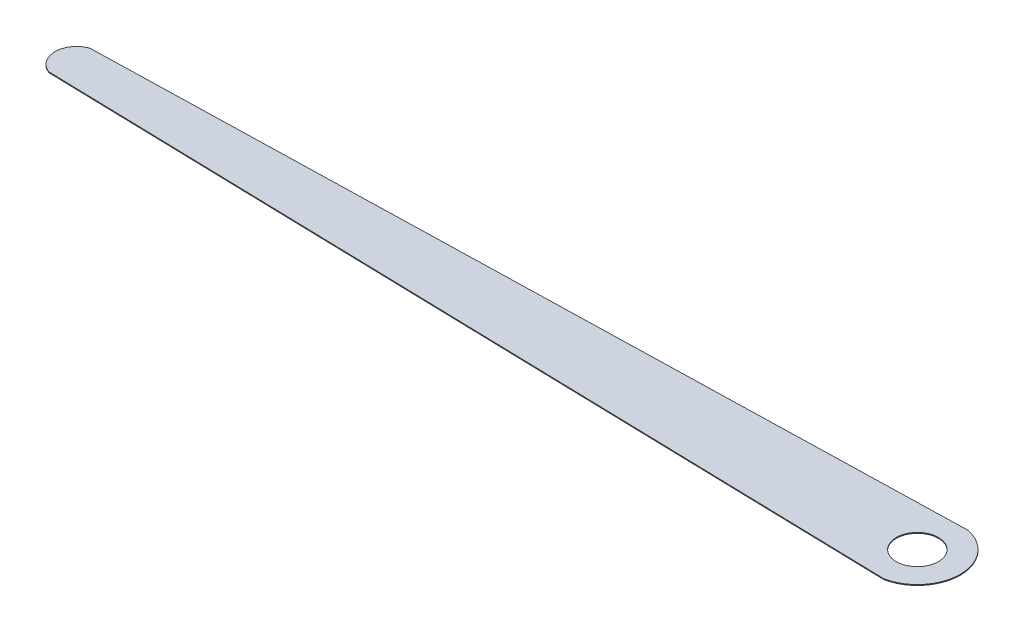
ISO-10303-21;
HEADER;
FILE_DESCRIPTION(('STEP AP214'),'2;1');
FILE_NAME('part.step','',(''),(''),'','','');
FILE_SCHEMA(('AUTOMOTIVE_DESIGN { 1 0 10303 214 1 1 1 1 }'));
ENDSEC;
DATA;
#1=APPLICATION_CONTEXT('core data for automotive mechanical design processes');
#2=APPLICATION_PROTOCOL_DEFINITION('international standard','automotive_design',2000,#1);
#3=PRODUCT_CONTEXT('',#1,'mechanical');
#4=PRODUCT('Part','Part','',(#3));
#5=PRODUCT_RELATED_PRODUCT_CATEGORY('part','',(#4));
#6=PRODUCT_DEFINITION_FORMATION('','',#4);
#7=PRODUCT_DEFINITION_CONTEXT('part definition',#1,'design');
#8=PRODUCT_DEFINITION('design','',#6,#7);
#9=PRODUCT_DEFINITION_SHAPE('','',#8);
#10=(LENGTH_UNIT() NAMED_UNIT(*) SI_UNIT(.MILLI.,.METRE.));
#11=(NAMED_UNIT(*) PLANE_ANGLE_UNIT() SI_UNIT($,.RADIAN.));
#12=(NAMED_UNIT(*) SI_UNIT($,.STERADIAN.) SOLID_ANGLE_UNIT());
#13=UNCERTAINTY_MEASURE_WITH_UNIT(LENGTH_MEASURE(1.E-05),#10,'distance_accuracy_value','');
#14=(GEOMETRIC_REPRESENTATION_CONTEXT(3) GLOBAL_UNCERTAINTY_ASSIGNED_CONTEXT((#13)) GLOBAL_UNIT_ASSIGNED_CONTEXT((#10,
#11,#12)) REPRESENTATION_CONTEXT('',''));
#15=CARTESIAN_POINT('',(0.,0.,0.));
#16=DIRECTION('',(0.,0.,1.));
#17=DIRECTION('',(1.,0.,0.));
#18=AXIS2_PLACEMENT_3D('',#15,#16,#17);
#19=CARTESIAN_POINT('',(-1.02879497937869,0.1,4.99999999999998));
#20=DIRECTION('',(0.,-1.,0.));
#21=DIRECTION('',(0.,0.,-1.));
#22=AXIS2_PLACEMENT_3D('',#19,#20,#21);
#23=PLANE('',#22);
#24=CARTESIAN_POINT('',(-1.02879497937869,0.1,4.99999999999998));
#25=DIRECTION('',(0.,1.,0.));
#26=DIRECTION('',(0.,0.,-1.));
#27=AXIS2_PLACEMENT_3D('',#24,#25,#26);
#28=CIRCLE('',#27,5.1047447643927);
#29=CARTESIAN_POINT('',(0.,0.1,9.99999999999997));
#30=VERTEX_POINT('',#29);
#31=CARTESIAN_POINT('',(0.,0.1,0.));
#32=VERTEX_POINT('',#31);
#33=EDGE_CURVE('E85',#30,#32,#28,.T.);
#34=ORIENTED_EDGE('',*,*,#33,.T.);
#35=DIRECTION('',(-0.999683329306351,0.,0.0251642823654999));
#36=VECTOR('',#35,1.);
#37=CARTESIAN_POINT('',(0.,0.1,0.));
#38=LINE('',#37,#36);
#39=CARTESIAN_POINT('',(-101.873461228566,0.1,2.56438460935946));
#40=VERTEX_POINT('',#39);
#41=EDGE_CURVE('E80',#32,#40,#38,.T.);
#42=ORIENTED_EDGE('',*,*,#41,.T.);
#43=CARTESIAN_POINT('',(-101.028794979379,0.1,4.99999999999998));
#44=DIRECTION('',(0.,1.,0.));
#45=DIRECTION('',(0.,0.,1.));
#46=AXIS2_PLACEMENT_3D('',#43,#44,#45);
#47=CIRCLE('',#46,2.57792230364699);
#48=CARTESIAN_POINT('',(-101.873461228566,0.1,7.4356153906405));
#49=VERTEX_POINT('',#48);
#50=EDGE_CURVE('E83',#40,#49,#47,.T.);
#51=ORIENTED_EDGE('',*,*,#50,.T.);
#52=DIRECTION('',(0.999683329306351,0.,0.0251642823654999));
#53=VECTOR('',#52,1.);
#54=CARTESIAN_POINT('',(-101.873461228566,0.1,7.4356153906405));
#55=LINE('',#54,#53);
#56=EDGE_CURVE('E50',#49,#30,#55,.T.);
#57=ORIENTED_EDGE('',*,*,#56,.T.);
#58=EDGE_LOOP('',(#34,#42,#51,#57));
#59=FACE_BOUND('',#58,.T.);
#60=CARTESIAN_POINT('',(-1.02879497937869,0.1,4.99999999999998));
#61=DIRECTION('',(0.,1.,0.));
#62=DIRECTION('',(0.,0.,1.));
#63=AXIS2_PLACEMENT_3D('',#60,#61,#62);
#64=CIRCLE('',#63,2.5);
#65=CARTESIAN_POINT('',(-1.02879497937869,0.1,7.49999999999998));
#66=VERTEX_POINT('',#65);
#67=EDGE_CURVE('E100',#66,#66,#64,.T.);
#68=ORIENTED_EDGE('',*,*,#67,.F.);
#69=EDGE_LOOP('',(#68));
#70=FACE_BOUND('',#69,.T.);
#71=ADVANCED_FACE('F33',(#59,#70),#23,.F.);
#72=CARTESIAN_POINT('',(-1.02879497937869,0.,4.99999999999998));
#73=DIRECTION('',(0.,-1.,0.));
#74=DIRECTION('',(0.,0.,-1.));
#75=AXIS2_PLACEMENT_3D('',#72,#73,#74);
#76=PLANE('',#75);
#77=CARTESIAN_POINT('',(-1.02879497937869,0.,4.99999999999998));
#78=DIRECTION('',(0.,1.,0.));
#79=DIRECTION('',(0.,0.,-1.));
#80=AXIS2_PLACEMENT_3D('',#77,#78,#79);
#81=CIRCLE('',#80,5.1047447643927);
#82=CARTESIAN_POINT('',(0.,0.,9.99999999999997));
#83=VERTEX_POINT('',#82);
#84=CARTESIAN_POINT('',(0.,0.,0.));
#85=VERTEX_POINT('',#84);
#86=EDGE_CURVE('E97',#83,#85,#81,.T.);
#87=ORIENTED_EDGE('',*,*,#86,.F.);
#88=DIRECTION('',(0.999683329306351,0.,0.0251642823654999));
#89=VECTOR('',#88,1.);
#90=CARTESIAN_POINT('',(-101.873461228566,0.,7.4356153906405));
#91=LINE('',#90,#89);
#92=CARTESIAN_POINT('',(-101.873461228566,0.,7.4356153906405));
#93=VERTEX_POINT('',#92);
#94=EDGE_CURVE('E73',#93,#83,#91,.T.);
#95=ORIENTED_EDGE('',*,*,#94,.F.);
#96=CARTESIAN_POINT('',(-101.028794979379,0.,4.99999999999998));
#97=DIRECTION('',(0.,1.,0.));
#98=DIRECTION('',(0.,0.,1.));
#99=AXIS2_PLACEMENT_3D('',#96,#97,#98);
#100=CIRCLE('',#99,2.57792230364699);
#101=CARTESIAN_POINT('',(-101.873461228566,0.,2.56438460935946));
#102=VERTEX_POINT('',#101);
#103=EDGE_CURVE('E67',#102,#93,#100,.T.);
#104=ORIENTED_EDGE('',*,*,#103,.F.);
#105=DIRECTION('',(-0.999683329306351,0.,0.0251642823654999));
#106=VECTOR('',#105,1.);
#107=CARTESIAN_POINT('',(0.,0.,0.));
#108=LINE('',#107,#106);
#109=EDGE_CURVE('E89',#85,#102,#108,.T.);
#110=ORIENTED_EDGE('',*,*,#109,.F.);
#111=EDGE_LOOP('',(#87,#95,#104,#110));
#112=FACE_BOUND('',#111,.T.);
#113=CARTESIAN_POINT('',(-1.02879497937869,0.,4.99999999999998));
#114=DIRECTION('',(0.,1.,0.));
#115=DIRECTION('',(0.,0.,1.));
#116=AXIS2_PLACEMENT_3D('',#113,#114,#115);
#117=CIRCLE('',#116,2.5);
#118=CARTESIAN_POINT('',(-1.02879497937869,0.,7.49999999999998));
#119=VERTEX_POINT('',#118);
#120=EDGE_CURVE('E112',#119,#119,#117,.T.);
#121=ORIENTED_EDGE('',*,*,#120,.T.);
#122=EDGE_LOOP('',(#121));
#123=FACE_BOUND('',#122,.T.);
#124=ADVANCED_FACE('F108',(#112,#123),#76,.T.);
#125=CARTESIAN_POINT('',(-1.02879497937869,0.1,4.99999999999998));
#126=DIRECTION('',(0.,-1.,0.));
#127=DIRECTION('',(0.,0.,-1.));
#128=AXIS2_PLACEMENT_3D('',#125,#126,#127);
#129=CYLINDRICAL_SURFACE('',#128,5.1047447643927);
#130=ORIENTED_EDGE('',*,*,#86,.T.);
#131=DIRECTION('',(0.,-1.,0.));
#132=VECTOR('',#131,1.);
#133=CARTESIAN_POINT('',(0.,0.1,0.));
#134=LINE('',#133,#132);
#135=EDGE_CURVE('E11',#32,#85,#134,.T.);
#136=ORIENTED_EDGE('',*,*,#135,.F.);
#137=ORIENTED_EDGE('',*,*,#33,.F.);
#138=DIRECTION('',(0.,-1.,0.));
#139=VECTOR('',#138,1.);
#140=CARTESIAN_POINT('',(0.,0.1,9.99999999999997));
#141=LINE('',#140,#139);
#142=EDGE_CURVE('E93',#30,#83,#141,.T.);
#143=ORIENTED_EDGE('',*,*,#142,.T.);
#144=EDGE_LOOP('',(#130,#136,#137,#143));
#145=FACE_BOUND('',#144,.T.);
#146=ADVANCED_FACE('F35',(#145),#129,.T.);
#147=CARTESIAN_POINT('',(0.,0.1,0.));
#148=DIRECTION('',(0.0251642823654999,0.,0.999683329306351));
#149=DIRECTION('',(0.999683329306351,0.,-0.0251642823654999));
#150=AXIS2_PLACEMENT_3D('',#147,#148,#149);
#151=PLANE('',#150);
#152=ORIENTED_EDGE('',*,*,#109,.T.);
#153=DIRECTION('',(0.,-1.,0.));
#154=VECTOR('',#153,1.);
#155=CARTESIAN_POINT('',(-101.873461228566,0.1,2.56438460935946));
#156=LINE('',#155,#154);
#157=EDGE_CURVE('E42',#40,#102,#156,.T.);
#158=ORIENTED_EDGE('',*,*,#157,.F.);
#159=ORIENTED_EDGE('',*,*,#41,.F.);
#160=ORIENTED_EDGE('',*,*,#135,.T.);
#161=EDGE_LOOP('',(#152,#158,#159,#160));
#162=FACE_BOUND('',#161,.T.);
#163=ADVANCED_FACE('F88',(#162),#151,.F.);
#164=CARTESIAN_POINT('',(-101.028794979379,0.1,4.99999999999998));
#165=DIRECTION('',(0.,-1.,0.));
#166=DIRECTION('',(0.,0.,-1.));
#167=AXIS2_PLACEMENT_3D('',#164,#165,#166);
#168=CYLINDRICAL_SURFACE('',#167,2.57792230364699);
#169=ORIENTED_EDGE('',*,*,#103,.T.);
#170=DIRECTION('',(0.,-1.,0.));
#171=VECTOR('',#170,1.);
#172=CARTESIAN_POINT('',(-101.873461228566,0.1,7.4356153906405));
#173=LINE('',#172,#171);
#174=EDGE_CURVE('E90',#49,#93,#173,.T.);
#175=ORIENTED_EDGE('',*,*,#174,.F.);
#176=ORIENTED_EDGE('',*,*,#50,.F.);
#177=ORIENTED_EDGE('',*,*,#157,.T.);
#178=EDGE_LOOP('',(#169,#175,#176,#177));
#179=FACE_BOUND('',#178,.T.);
#180=ADVANCED_FACE('F91',(#179),#168,.T.);
#181=CARTESIAN_POINT('',(-101.873461228566,0.1,7.4356153906405));
#182=DIRECTION('',(0.0251642823654999,0.,-0.999683329306351));
#183=DIRECTION('',(-0.999683329306351,0.,-0.0251642823654999));
#184=AXIS2_PLACEMENT_3D('',#181,#182,#183);
#185=PLANE('',#184);
#186=ORIENTED_EDGE('',*,*,#94,.T.);
#187=ORIENTED_EDGE('',*,*,#142,.F.);
#188=ORIENTED_EDGE('',*,*,#56,.F.);
#189=ORIENTED_EDGE('',*,*,#174,.T.);
#190=EDGE_LOOP('',(#186,#187,#188,#189));
#191=FACE_BOUND('',#190,.T.);
#192=ADVANCED_FACE('F105',(#191),#185,.F.);
#193=CARTESIAN_POINT('',(-1.02879497937869,0.1,4.99999999999998));
#194=DIRECTION('',(0.,-1.,0.));
#195=DIRECTION('',(0.,0.,-1.));
#196=AXIS2_PLACEMENT_3D('',#193,#194,#195);
#197=CYLINDRICAL_SURFACE('',#196,2.5);
#198=ORIENTED_EDGE('',*,*,#67,.T.);
#199=EDGE_LOOP('',(#198));
#200=FACE_BOUND('',#199,.T.);
#201=ORIENTED_EDGE('',*,*,#120,.F.);
#202=EDGE_LOOP('',(#201));
#203=FACE_BOUND('',#202,.T.);
#204=ADVANCED_FACE('F118',(#200,#203),#197,.F.);
#205=CLOSED_SHELL('',(#71,#124,#146,#163,#180,#192,#204));
#206=MANIFOLD_SOLID_BREP('B2',#205);
#207=ADVANCED_BREP_SHAPE_REPRESENTATION('',(#18,#206),#14);
#208=SHAPE_DEFINITION_REPRESENTATION(#9,#207);
ENDSEC;
END-ISO-10303-21;
